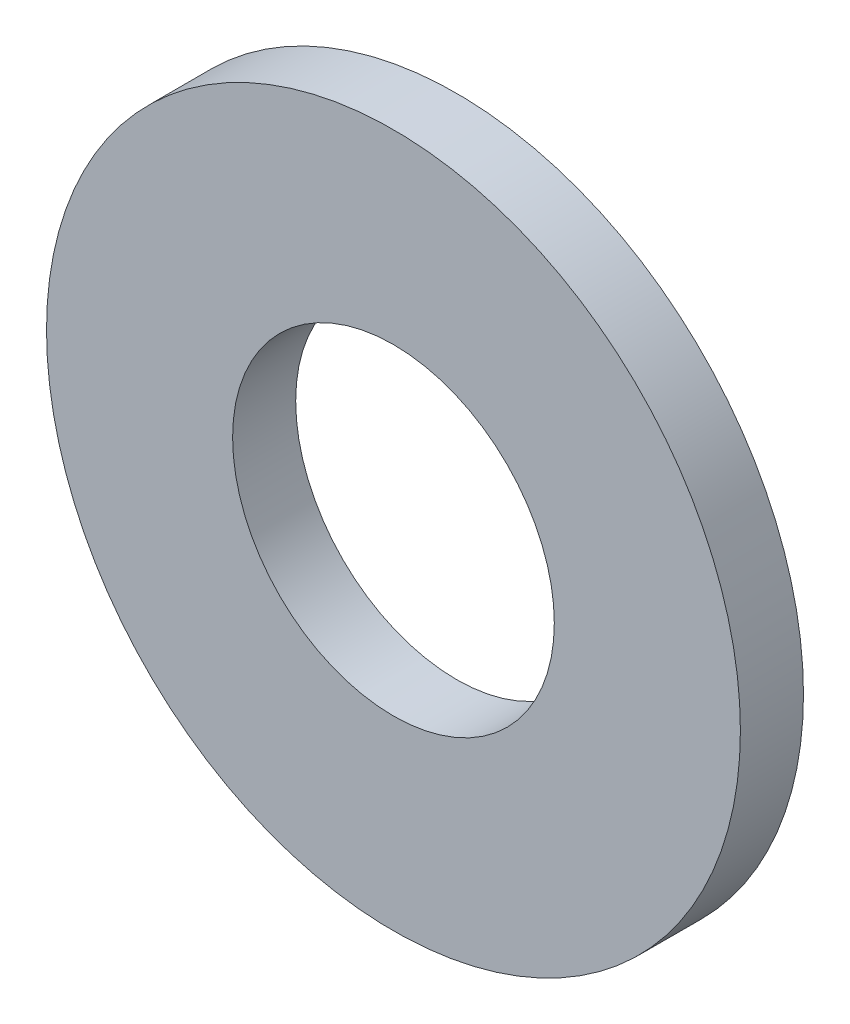
ISO-10303-21;
HEADER;
FILE_DESCRIPTION(('STEP AP214'),'2;1');
FILE_NAME('part.step','',(''),(''),'','','');
FILE_SCHEMA(('AUTOMOTIVE_DESIGN { 1 0 10303 214 1 1 1 1 }'));
ENDSEC;
DATA;
#1=APPLICATION_CONTEXT('core data for automotive mechanical design processes');
#2=APPLICATION_PROTOCOL_DEFINITION('international standard','automotive_design',2000,#1);
#3=PRODUCT_CONTEXT('',#1,'mechanical');
#4=PRODUCT('Part','Part','',(#3));
#5=PRODUCT_RELATED_PRODUCT_CATEGORY('part','',(#4));
#6=PRODUCT_DEFINITION_FORMATION('','',#4);
#7=PRODUCT_DEFINITION_CONTEXT('part definition',#1,'design');
#8=PRODUCT_DEFINITION('design','',#6,#7);
#9=PRODUCT_DEFINITION_SHAPE('','',#8);
#10=(LENGTH_UNIT() NAMED_UNIT(*) SI_UNIT(.MILLI.,.METRE.));
#11=(NAMED_UNIT(*) PLANE_ANGLE_UNIT() SI_UNIT($,.RADIAN.));
#12=(NAMED_UNIT(*) SI_UNIT($,.STERADIAN.) SOLID_ANGLE_UNIT());
#13=UNCERTAINTY_MEASURE_WITH_UNIT(LENGTH_MEASURE(1.E-05),#10,'distance_accuracy_value','');
#14=(GEOMETRIC_REPRESENTATION_CONTEXT(3) GLOBAL_UNCERTAINTY_ASSIGNED_CONTEXT((#13)) GLOBAL_UNIT_ASSIGNED_CONTEXT((#10,
#11,#12)) REPRESENTATION_CONTEXT('',''));
#15=CARTESIAN_POINT('',(0.,0.,0.));
#16=DIRECTION('',(0.,0.,1.));
#17=DIRECTION('',(1.,0.,0.));
#18=AXIS2_PLACEMENT_3D('',#15,#16,#17);
#19=CARTESIAN_POINT('',(0.,0.,0.));
#20=DIRECTION('',(0.,0.,1.));
#21=DIRECTION('',(1.,0.,0.));
#22=AXIS2_PLACEMENT_3D('',#19,#20,#21);
#23=CYLINDRICAL_SURFACE('',#22,2.55);
#24=CARTESIAN_POINT('',(0.,0.,1.));
#25=DIRECTION('',(0.,0.,-1.));
#26=DIRECTION('',(0.,-1.,0.));
#27=AXIS2_PLACEMENT_3D('',#24,#25,#26);
#28=CIRCLE('',#27,2.55);
#29=CARTESIAN_POINT('',(0.,-2.55,1.));
#30=VERTEX_POINT('',#29);
#31=EDGE_CURVE('E8',#30,#30,#28,.T.);
#32=ORIENTED_EDGE('',*,*,#31,.F.);
#33=EDGE_LOOP('',(#32));
#34=FACE_BOUND('',#33,.T.);
#35=CARTESIAN_POINT('',(0.,0.,0.));
#36=DIRECTION('',(0.,0.,1.));
#37=DIRECTION('',(1.,0.,0.));
#38=AXIS2_PLACEMENT_3D('',#35,#36,#37);
#39=CIRCLE('',#38,2.55);
#40=CARTESIAN_POINT('',(2.55,0.,0.));
#41=VERTEX_POINT('',#40);
#42=EDGE_CURVE('E26',#41,#41,#39,.T.);
#43=ORIENTED_EDGE('',*,*,#42,.F.);
#44=EDGE_LOOP('',(#43));
#45=FACE_BOUND('',#44,.T.);
#46=ADVANCED_FACE('F13',(#34,#45),#23,.F.);
#47=CARTESIAN_POINT('',(0.,0.,0.));
#48=DIRECTION('',(0.,0.,1.));
#49=DIRECTION('',(1.,0.,0.));
#50=AXIS2_PLACEMENT_3D('',#47,#48,#49);
#51=CYLINDRICAL_SURFACE('',#50,5.5);
#52=CARTESIAN_POINT('',(0.,0.,1.));
#53=DIRECTION('',(0.,0.,1.));
#54=DIRECTION('',(1.,0.,0.));
#55=AXIS2_PLACEMENT_3D('',#52,#53,#54);
#56=CIRCLE('',#55,5.5);
#57=CARTESIAN_POINT('',(5.5,0.,1.));
#58=VERTEX_POINT('',#57);
#59=EDGE_CURVE('E21',#58,#58,#56,.T.);
#60=ORIENTED_EDGE('',*,*,#59,.F.);
#61=EDGE_LOOP('',(#60));
#62=FACE_BOUND('',#61,.T.);
#63=CARTESIAN_POINT('',(0.,0.,0.));
#64=DIRECTION('',(0.,0.,-1.));
#65=DIRECTION('',(0.,-1.,0.));
#66=AXIS2_PLACEMENT_3D('',#63,#64,#65);
#67=CIRCLE('',#66,5.5);
#68=CARTESIAN_POINT('',(0.,-5.5,0.));
#69=VERTEX_POINT('',#68);
#70=EDGE_CURVE('E17',#69,#69,#67,.T.);
#71=ORIENTED_EDGE('',*,*,#70,.F.);
#72=EDGE_LOOP('',(#71));
#73=FACE_BOUND('',#72,.T.);
#74=ADVANCED_FACE('F15',(#62,#73),#51,.T.);
#75=CARTESIAN_POINT('',(0.,0.,1.));
#76=DIRECTION('',(0.,0.,1.));
#77=DIRECTION('',(1.,0.,0.));
#78=AXIS2_PLACEMENT_3D('',#75,#76,#77);
#79=PLANE('',#78);
#80=ORIENTED_EDGE('',*,*,#31,.T.);
#81=EDGE_LOOP('',(#80));
#82=FACE_BOUND('',#81,.T.);
#83=ORIENTED_EDGE('',*,*,#59,.T.);
#84=EDGE_LOOP('',(#83));
#85=FACE_BOUND('',#84,.T.);
#86=ADVANCED_FACE('F37',(#82,#85),#79,.T.);
#87=CARTESIAN_POINT('',(0.,0.,0.));
#88=DIRECTION('',(0.,0.,1.));
#89=DIRECTION('',(1.,0.,0.));
#90=AXIS2_PLACEMENT_3D('',#87,#88,#89);
#91=PLANE('',#90);
#92=ORIENTED_EDGE('',*,*,#42,.T.);
#93=EDGE_LOOP('',(#92));
#94=FACE_BOUND('',#93,.T.);
#95=ORIENTED_EDGE('',*,*,#70,.T.);
#96=EDGE_LOOP('',(#95));
#97=FACE_BOUND('',#96,.T.);
#98=ADVANCED_FACE('F34',(#94,#97),#91,.F.);
#99=CLOSED_SHELL('',(#46,#74,#86,#98));
#100=MANIFOLD_SOLID_BREP('B1',#99);
#101=ADVANCED_BREP_SHAPE_REPRESENTATION('',(#18,#100),#14);
#102=SHAPE_DEFINITION_REPRESENTATION(#9,#101);
ENDSEC;
END-ISO-10303-21;
